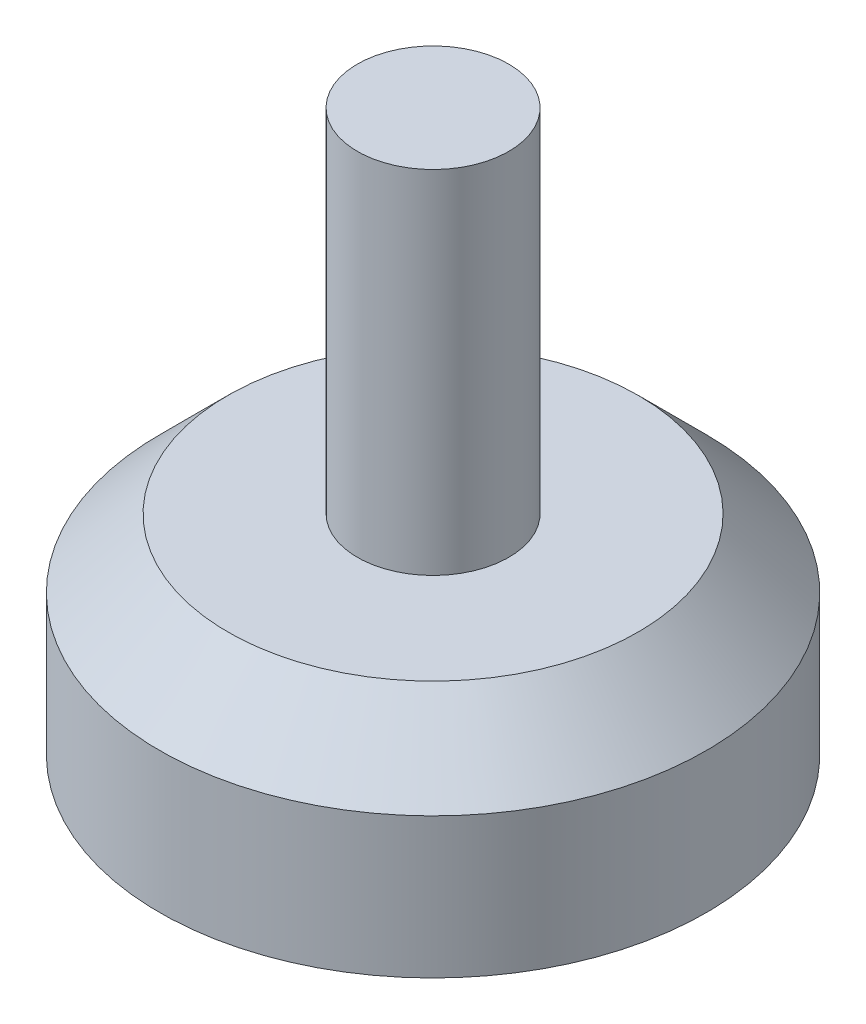
ISO-10303-21;
HEADER;
FILE_DESCRIPTION(('STEP AP214'),'2;1');
FILE_NAME('part.step','',(''),(''),'','','');
FILE_SCHEMA(('AUTOMOTIVE_DESIGN { 1 0 10303 214 1 1 1 1 }'));
ENDSEC;
DATA;
#1=APPLICATION_CONTEXT('core data for automotive mechanical design processes');
#2=APPLICATION_PROTOCOL_DEFINITION('international standard','automotive_design',2000,#1);
#3=PRODUCT_CONTEXT('',#1,'mechanical');
#4=PRODUCT('Part','Part','',(#3));
#5=PRODUCT_RELATED_PRODUCT_CATEGORY('part','',(#4));
#6=PRODUCT_DEFINITION_FORMATION('','',#4);
#7=PRODUCT_DEFINITION_CONTEXT('part definition',#1,'design');
#8=PRODUCT_DEFINITION('design','',#6,#7);
#9=PRODUCT_DEFINITION_SHAPE('','',#8);
#10=(LENGTH_UNIT() NAMED_UNIT(*) SI_UNIT(.MILLI.,.METRE.));
#11=(NAMED_UNIT(*) PLANE_ANGLE_UNIT() SI_UNIT($,.RADIAN.));
#12=(NAMED_UNIT(*) SI_UNIT($,.STERADIAN.) SOLID_ANGLE_UNIT());
#13=UNCERTAINTY_MEASURE_WITH_UNIT(LENGTH_MEASURE(1.E-05),#10,'distance_accuracy_value','');
#14=(GEOMETRIC_REPRESENTATION_CONTEXT(3) GLOBAL_UNCERTAINTY_ASSIGNED_CONTEXT((#13)) GLOBAL_UNIT_ASSIGNED_CONTEXT((#10,
#11,#12)) REPRESENTATION_CONTEXT('',''));
#15=CARTESIAN_POINT('',(0.,0.,0.));
#16=DIRECTION('',(0.,0.,1.));
#17=DIRECTION('',(1.,0.,0.));
#18=AXIS2_PLACEMENT_3D('',#15,#16,#17);
#19=CARTESIAN_POINT('',(0.,0.,0.));
#20=DIRECTION('',(0.,1.,0.));
#21=DIRECTION('',(0.,0.,1.));
#22=AXIS2_PLACEMENT_3D('',#19,#20,#21);
#23=PLANE('',#22);
#24=CARTESIAN_POINT('',(0.,0.,0.));
#25=DIRECTION('',(0.,-1.,0.));
#26=DIRECTION('',(0.,0.,-1.));
#27=AXIS2_PLACEMENT_3D('',#24,#25,#26);
#28=CIRCLE('',#27,44.0532208050979);
#29=CARTESIAN_POINT('',(0.,0.,-44.0532208050979));
#30=VERTEX_POINT('',#29);
#31=EDGE_CURVE('E10',#30,#30,#28,.T.);
#32=ORIENTED_EDGE('',*,*,#31,.T.);
#33=EDGE_LOOP('',(#32));
#34=FACE_BOUND('',#33,.T.);
#35=ADVANCED_FACE('F31',(#34),#23,.F.);
#36=CARTESIAN_POINT('',(0.,0.,0.));
#37=DIRECTION('',(0.,-1.,0.));
#38=DIRECTION('',(0.,0.,-1.));
#39=AXIS2_PLACEMENT_3D('',#36,#37,#38);
#40=CYLINDRICAL_SURFACE('',#39,44.0532208050979);
#41=ORIENTED_EDGE('',*,*,#31,.F.);
#42=EDGE_LOOP('',(#41));
#43=FACE_BOUND('',#42,.T.);
#44=CARTESIAN_POINT('',(0.,22.6166088954744,0.));
#45=DIRECTION('',(0.,-1.,0.));
#46=DIRECTION('',(0.,0.,-1.));
#47=AXIS2_PLACEMENT_3D('',#44,#45,#46);
#48=CIRCLE('',#47,44.0532208050979);
#49=CARTESIAN_POINT('',(0.,22.6166088954744,-44.0532208050979));
#50=VERTEX_POINT('',#49);
#51=EDGE_CURVE('E37',#50,#50,#48,.T.);
#52=ORIENTED_EDGE('',*,*,#51,.T.);
#53=EDGE_LOOP('',(#52));
#54=FACE_BOUND('',#53,.T.);
#55=ADVANCED_FACE('F66',(#43,#54),#40,.T.);
#56=CARTESIAN_POINT('',(0.,33.629914096749,0.));
#57=DIRECTION('',(0.,-1.,0.));
#58=DIRECTION('',(0.,0.,-1.));
#59=AXIS2_PLACEMENT_3D('',#56,#57,#58);
#60=CONICAL_SURFACE('',#59,33.0399156038236,0.785398163397436);
#61=ORIENTED_EDGE('',*,*,#51,.F.);
#62=EDGE_LOOP('',(#61));
#63=FACE_BOUND('',#62,.T.);
#64=CARTESIAN_POINT('',(0.,33.629914096749,0.));
#65=DIRECTION('',(0.,-1.,0.));
#66=DIRECTION('',(0.,0.,-1.));
#67=AXIS2_PLACEMENT_3D('',#64,#65,#66);
#68=CIRCLE('',#67,33.0399156038236);
#69=CARTESIAN_POINT('',(0.,33.629914096749,-33.0399156038236));
#70=VERTEX_POINT('',#69);
#71=EDGE_CURVE('E41',#70,#70,#68,.T.);
#72=ORIENTED_EDGE('',*,*,#71,.T.);
#73=EDGE_LOOP('',(#72));
#74=FACE_BOUND('',#73,.T.);
#75=ADVANCED_FACE('F70',(#63,#74),#60,.T.);
#76=CARTESIAN_POINT('',(-33.0399156038236,33.629914096749,0.));
#77=DIRECTION('',(0.,-1.,0.));
#78=DIRECTION('',(0.,0.,-1.));
#79=AXIS2_PLACEMENT_3D('',#76,#77,#78);
#80=PLANE('',#79);
#81=ORIENTED_EDGE('',*,*,#71,.F.);
#82=EDGE_LOOP('',(#81));
#83=FACE_BOUND('',#82,.T.);
#84=CARTESIAN_POINT('',(0.,33.629914096749,0.));
#85=DIRECTION('',(0.,-1.,0.));
#86=DIRECTION('',(0.,0.,-1.));
#87=AXIS2_PLACEMENT_3D('',#84,#85,#86);
#88=CIRCLE('',#87,12.1933021871253);
#89=CARTESIAN_POINT('',(0.,33.629914096749,-12.1933021871253));
#90=VERTEX_POINT('',#89);
#91=EDGE_CURVE('E45',#90,#90,#88,.T.);
#92=ORIENTED_EDGE('',*,*,#91,.T.);
#93=EDGE_LOOP('',(#92));
#94=FACE_BOUND('',#93,.T.);
#95=ADVANCED_FACE('F62',(#83,#94),#80,.F.);
#96=CARTESIAN_POINT('',(0.,0.,0.));
#97=DIRECTION('',(0.,-1.,0.));
#98=DIRECTION('',(0.,0.,-1.));
#99=AXIS2_PLACEMENT_3D('',#96,#97,#98);
#100=CYLINDRICAL_SURFACE('',#99,12.1933021871253);
#101=ORIENTED_EDGE('',*,*,#91,.F.);
#102=EDGE_LOOP('',(#101));
#103=FACE_BOUND('',#102,.T.);
#104=CARTESIAN_POINT('',(0.,90.269769417589,0.));
#105=DIRECTION('',(0.,-1.,0.));
#106=DIRECTION('',(0.,0.,-1.));
#107=AXIS2_PLACEMENT_3D('',#104,#105,#106);
#108=CIRCLE('',#107,12.1933021871253);
#109=CARTESIAN_POINT('',(0.,90.269769417589,-12.1933021871253));
#110=VERTEX_POINT('',#109);
#111=EDGE_CURVE('E50',#110,#110,#108,.T.);
#112=ORIENTED_EDGE('',*,*,#111,.T.);
#113=EDGE_LOOP('',(#112));
#114=FACE_BOUND('',#113,.T.);
#115=ADVANCED_FACE('F54',(#103,#114),#100,.T.);
#116=CARTESIAN_POINT('',(-12.1933021871253,90.269769417589,0.));
#117=DIRECTION('',(0.,-1.,0.));
#118=DIRECTION('',(0.,0.,-1.));
#119=AXIS2_PLACEMENT_3D('',#116,#117,#118);
#120=PLANE('',#119);
#121=ORIENTED_EDGE('',*,*,#111,.F.);
#122=EDGE_LOOP('',(#121));
#123=FACE_BOUND('',#122,.T.);
#124=ADVANCED_FACE('F56',(#123),#120,.F.);
#125=CLOSED_SHELL('',(#35,#55,#75,#95,#115,#124));
#126=MANIFOLD_SOLID_BREP('B2',#125);
#127=ADVANCED_BREP_SHAPE_REPRESENTATION('',(#18,#126),#14);
#128=SHAPE_DEFINITION_REPRESENTATION(#9,#127);
ENDSEC;
END-ISO-10303-21;
